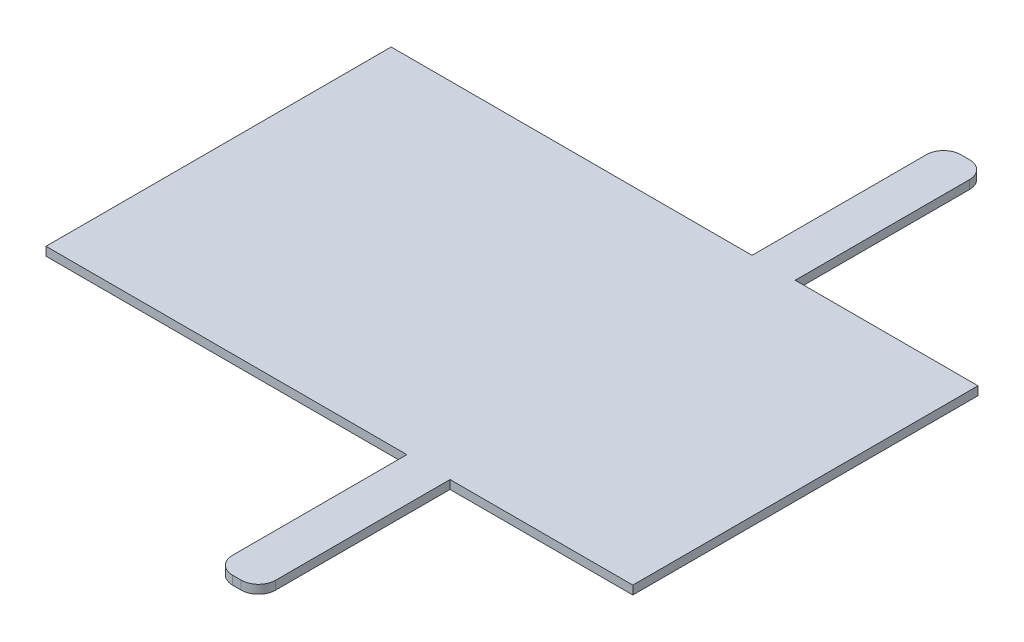
ISO-10303-21;
HEADER;
FILE_DESCRIPTION(('STEP AP214'),'2;1');
FILE_NAME('part.step','',(''),(''),'','','');
FILE_SCHEMA(('AUTOMOTIVE_DESIGN { 1 0 10303 214 1 1 1 1 }'));
ENDSEC;
DATA;
#1=APPLICATION_CONTEXT('core data for automotive mechanical design processes');
#2=APPLICATION_PROTOCOL_DEFINITION('international standard','automotive_design',2000,#1);
#3=PRODUCT_CONTEXT('',#1,'mechanical');
#4=PRODUCT('Part','Part','',(#3));
#5=PRODUCT_RELATED_PRODUCT_CATEGORY('part','',(#4));
#6=PRODUCT_DEFINITION_FORMATION('','',#4);
#7=PRODUCT_DEFINITION_CONTEXT('part definition',#1,'design');
#8=PRODUCT_DEFINITION('design','',#6,#7);
#9=PRODUCT_DEFINITION_SHAPE('','',#8);
#10=(LENGTH_UNIT() NAMED_UNIT(*) SI_UNIT(.MILLI.,.METRE.));
#11=(NAMED_UNIT(*) PLANE_ANGLE_UNIT() SI_UNIT($,.RADIAN.));
#12=(NAMED_UNIT(*) SI_UNIT($,.STERADIAN.) SOLID_ANGLE_UNIT());
#13=UNCERTAINTY_MEASURE_WITH_UNIT(LENGTH_MEASURE(1.E-05),#10,'distance_accuracy_value','');
#14=(GEOMETRIC_REPRESENTATION_CONTEXT(3) GLOBAL_UNCERTAINTY_ASSIGNED_CONTEXT((#13)) GLOBAL_UNIT_ASSIGNED_CONTEXT((#10,
#11,#12)) REPRESENTATION_CONTEXT('',''));
#15=CARTESIAN_POINT('',(0.,0.,0.));
#16=DIRECTION('',(0.,0.,1.));
#17=DIRECTION('',(1.,0.,0.));
#18=AXIS2_PLACEMENT_3D('',#15,#16,#17);
#19=CARTESIAN_POINT('',(-691.29647542446,5.,-422.631578947368));
#20=DIRECTION('',(1.,0.,0.));
#21=DIRECTION('',(0.,0.,-1.));
#22=AXIS2_PLACEMENT_3D('',#19,#20,#21);
#23=PLANE('',#22);
#24=DIRECTION('',(0.,0.,1.));
#25=VECTOR('',#24,1.);
#26=CARTESIAN_POINT('',(-691.29647542446,0.,-422.631578947368));
#27=LINE('',#26,#25);
#28=CARTESIAN_POINT('',(-691.29647542446,0.,-422.631578947368));
#29=VERTEX_POINT('',#28);
#30=CARTESIAN_POINT('',(-691.29647542446,0.,-222.631578947368));
#31=VERTEX_POINT('',#30);
#32=EDGE_CURVE('E190',#29,#31,#27,.T.);
#33=ORIENTED_EDGE('',*,*,#32,.T.);
#34=DIRECTION('',(0.,-1.,0.));
#35=VECTOR('',#34,1.);
#36=CARTESIAN_POINT('',(-691.29647542446,5.,-222.631578947368));
#37=LINE('',#36,#35);
#38=CARTESIAN_POINT('',(-691.29647542446,5.,-222.631578947368));
#39=VERTEX_POINT('',#38);
#40=EDGE_CURVE('E11',#39,#31,#37,.T.);
#41=ORIENTED_EDGE('',*,*,#40,.F.);
#42=DIRECTION('',(0.,0.,1.));
#43=VECTOR('',#42,1.);
#44=CARTESIAN_POINT('',(-691.29647542446,5.,-422.631578947368));
#45=LINE('',#44,#43);
#46=CARTESIAN_POINT('',(-691.29647542446,5.,-422.631578947368));
#47=VERTEX_POINT('',#46);
#48=EDGE_CURVE('E236',#47,#39,#45,.T.);
#49=ORIENTED_EDGE('',*,*,#48,.F.);
#50=DIRECTION('',(0.,-1.,0.));
#51=VECTOR('',#50,1.);
#52=CARTESIAN_POINT('',(-691.29647542446,5.,-422.631578947368));
#53=LINE('',#52,#51);
#54=EDGE_CURVE('E186',#47,#29,#53,.T.);
#55=ORIENTED_EDGE('',*,*,#54,.T.);
#56=EDGE_LOOP('',(#33,#41,#49,#55));
#57=FACE_BOUND('',#56,.T.);
#58=ADVANCED_FACE('F41',(#57),#23,.F.);
#59=CARTESIAN_POINT('',(-691.29647542446,5.,-222.631578947368));
#60=DIRECTION('',(0.,0.,-1.));
#61=DIRECTION('',(-1.,0.,0.));
#62=AXIS2_PLACEMENT_3D('',#59,#60,#61);
#63=PLANE('',#62);
#64=DIRECTION('',(1.,0.,0.));
#65=VECTOR('',#64,1.);
#66=CARTESIAN_POINT('',(-691.29647542446,0.,-222.631578947368));
#67=LINE('',#66,#65);
#68=CARTESIAN_POINT('',(-482.208642175763,0.,-222.631578947368));
#69=VERTEX_POINT('',#68);
#70=EDGE_CURVE('E194',#31,#69,#67,.T.);
#71=ORIENTED_EDGE('',*,*,#70,.T.);
#72=DIRECTION('',(0.,-1.,0.));
#73=VECTOR('',#72,1.);
#74=CARTESIAN_POINT('',(-482.208642175763,5.,-222.631578947368));
#75=LINE('',#74,#73);
#76=CARTESIAN_POINT('',(-482.208642175763,5.,-222.631578947368));
#77=VERTEX_POINT('',#76);
#78=EDGE_CURVE('E50',#77,#69,#75,.T.);
#79=ORIENTED_EDGE('',*,*,#78,.F.);
#80=DIRECTION('',(1.,0.,0.));
#81=VECTOR('',#80,1.);
#82=CARTESIAN_POINT('',(-691.29647542446,5.,-222.631578947368));
#83=LINE('',#82,#81);
#84=EDGE_CURVE('E125',#39,#77,#83,.T.);
#85=ORIENTED_EDGE('',*,*,#84,.F.);
#86=ORIENTED_EDGE('',*,*,#40,.T.);
#87=EDGE_LOOP('',(#71,#79,#85,#86));
#88=FACE_BOUND('',#87,.T.);
#89=ADVANCED_FACE('F358',(#88),#63,.F.);
#90=CARTESIAN_POINT('',(-482.208642175763,5.,-222.631578947368));
#91=DIRECTION('',(1.,0.,0.));
#92=DIRECTION('',(0.,0.,-1.));
#93=AXIS2_PLACEMENT_3D('',#90,#91,#92);
#94=PLANE('',#93);
#95=DIRECTION('',(0.,0.,1.));
#96=VECTOR('',#95,1.);
#97=CARTESIAN_POINT('',(-482.208642175763,0.,-222.631578947368));
#98=LINE('',#97,#96);
#99=CARTESIAN_POINT('',(-482.208642175763,0.,-121.631578947368));
#100=VERTEX_POINT('',#99);
#101=EDGE_CURVE('E197',#69,#100,#98,.T.);
#102=ORIENTED_EDGE('',*,*,#101,.T.);
#103=DIRECTION('',(0.,-1.,0.));
#104=VECTOR('',#103,1.);
#105=CARTESIAN_POINT('',(-482.208642175763,5.,-121.631578947368));
#106=LINE('',#105,#104);
#107=CARTESIAN_POINT('',(-482.208642175763,5.,-121.631578947368));
#108=VERTEX_POINT('',#107);
#109=EDGE_CURVE('E279',#108,#100,#106,.T.);
#110=ORIENTED_EDGE('',*,*,#109,.F.);
#111=DIRECTION('',(0.,0.,1.));
#112=VECTOR('',#111,1.);
#113=CARTESIAN_POINT('',(-482.208642175763,5.,-222.631578947368));
#114=LINE('',#113,#112);
#115=EDGE_CURVE('E289',#77,#108,#114,.T.);
#116=ORIENTED_EDGE('',*,*,#115,.F.);
#117=ORIENTED_EDGE('',*,*,#78,.T.);
#118=EDGE_LOOP('',(#102,#110,#116,#117));
#119=FACE_BOUND('',#118,.T.);
#120=ADVANCED_FACE('F287',(#119),#94,.F.);
#121=CARTESIAN_POINT('',(-472.208642175763,5.,-121.631578947368));
#122=DIRECTION('',(0.,-1.,0.));
#123=DIRECTION('',(0.,0.,-1.));
#124=AXIS2_PLACEMENT_3D('',#121,#122,#123);
#125=CYLINDRICAL_SURFACE('',#124,10.);
#126=CARTESIAN_POINT('',(-472.208642175763,0.,-121.631578947368));
#127=DIRECTION('',(0.,1.,0.));
#128=DIRECTION('',(0.,0.,1.));
#129=AXIS2_PLACEMENT_3D('',#126,#127,#128);
#130=CIRCLE('',#129,10.);
#131=CARTESIAN_POINT('',(-472.208642175763,0.,-111.631578947368));
#132=VERTEX_POINT('',#131);
#133=EDGE_CURVE('E200',#100,#132,#130,.T.);
#134=ORIENTED_EDGE('',*,*,#133,.T.);
#135=DIRECTION('',(0.,-1.,0.));
#136=VECTOR('',#135,1.);
#137=CARTESIAN_POINT('',(-472.208642175763,5.,-111.631578947368));
#138=LINE('',#137,#136);
#139=CARTESIAN_POINT('',(-472.208642175763,5.,-111.631578947368));
#140=VERTEX_POINT('',#139);
#141=EDGE_CURVE('E275',#140,#132,#138,.T.);
#142=ORIENTED_EDGE('',*,*,#141,.F.);
#143=CARTESIAN_POINT('',(-472.208642175763,5.,-121.631578947368));
#144=DIRECTION('',(0.,1.,0.));
#145=DIRECTION('',(0.,0.,1.));
#146=AXIS2_PLACEMENT_3D('',#143,#144,#145);
#147=CIRCLE('',#146,10.);
#148=EDGE_CURVE('E308',#108,#140,#147,.T.);
#149=ORIENTED_EDGE('',*,*,#148,.F.);
#150=ORIENTED_EDGE('',*,*,#109,.T.);
#151=EDGE_LOOP('',(#134,#142,#149,#150));
#152=FACE_BOUND('',#151,.T.);
#153=ADVANCED_FACE('F298',(#152),#125,.T.);
#154=CARTESIAN_POINT('',(-472.208642175763,5.,-111.631578947368));
#155=DIRECTION('',(0.,0.,-1.));
#156=DIRECTION('',(-1.,0.,0.));
#157=AXIS2_PLACEMENT_3D('',#154,#155,#156);
#158=PLANE('',#157);
#159=DIRECTION('',(1.,0.,0.));
#160=VECTOR('',#159,1.);
#161=CARTESIAN_POINT('',(-472.208642175763,0.,-111.631578947368));
#162=LINE('',#161,#160);
#163=CARTESIAN_POINT('',(-467.208642175763,0.,-111.631578947368));
#164=VERTEX_POINT('',#163);
#165=EDGE_CURVE('E203',#132,#164,#162,.T.);
#166=ORIENTED_EDGE('',*,*,#165,.T.);
#167=DIRECTION('',(0.,-1.,0.));
#168=VECTOR('',#167,1.);
#169=CARTESIAN_POINT('',(-467.208642175763,5.,-111.631578947368));
#170=LINE('',#169,#168);
#171=CARTESIAN_POINT('',(-467.208642175763,5.,-111.631578947368));
#172=VERTEX_POINT('',#171);
#173=EDGE_CURVE('E271',#172,#164,#170,.T.);
#174=ORIENTED_EDGE('',*,*,#173,.F.);
#175=DIRECTION('',(1.,0.,0.));
#176=VECTOR('',#175,1.);
#177=CARTESIAN_POINT('',(-472.208642175763,5.,-111.631578947368));
#178=LINE('',#177,#176);
#179=EDGE_CURVE('E304',#140,#172,#178,.T.);
#180=ORIENTED_EDGE('',*,*,#179,.F.);
#181=ORIENTED_EDGE('',*,*,#141,.T.);
#182=EDGE_LOOP('',(#166,#174,#180,#181));
#183=FACE_BOUND('',#182,.T.);
#184=ADVANCED_FACE('F302',(#183),#158,.F.);
#185=CARTESIAN_POINT('',(-467.208642175763,5.,-121.631578947368));
#186=DIRECTION('',(0.,-1.,0.));
#187=DIRECTION('',(0.,0.,-1.));
#188=AXIS2_PLACEMENT_3D('',#185,#186,#187);
#189=CYLINDRICAL_SURFACE('',#188,10.);
#190=CARTESIAN_POINT('',(-467.208642175763,0.,-121.631578947368));
#191=DIRECTION('',(0.,1.,0.));
#192=DIRECTION('',(0.,0.,1.));
#193=AXIS2_PLACEMENT_3D('',#190,#191,#192);
#194=CIRCLE('',#193,10.);
#195=CARTESIAN_POINT('',(-457.208642175763,0.,-121.631578947368));
#196=VERTEX_POINT('',#195);
#197=EDGE_CURVE('E206',#164,#196,#194,.T.);
#198=ORIENTED_EDGE('',*,*,#197,.T.);
#199=DIRECTION('',(0.,-1.,0.));
#200=VECTOR('',#199,1.);
#201=CARTESIAN_POINT('',(-457.208642175763,5.,-121.631578947368));
#202=LINE('',#201,#200);
#203=CARTESIAN_POINT('',(-457.208642175763,5.,-121.631578947368));
#204=VERTEX_POINT('',#203);
#205=EDGE_CURVE('E267',#204,#196,#202,.T.);
#206=ORIENTED_EDGE('',*,*,#205,.F.);
#207=CARTESIAN_POINT('',(-467.208642175763,5.,-121.631578947368));
#208=DIRECTION('',(0.,1.,0.));
#209=DIRECTION('',(0.,0.,1.));
#210=AXIS2_PLACEMENT_3D('',#207,#208,#209);
#211=CIRCLE('',#210,10.);
#212=EDGE_CURVE('E307',#172,#204,#211,.T.);
#213=ORIENTED_EDGE('',*,*,#212,.F.);
#214=ORIENTED_EDGE('',*,*,#173,.T.);
#215=EDGE_LOOP('',(#198,#206,#213,#214));
#216=FACE_BOUND('',#215,.T.);
#217=ADVANCED_FACE('F371',(#216),#189,.T.);
#218=CARTESIAN_POINT('',(-457.208642175763,5.,-222.631578947368));
#219=DIRECTION('',(-1.,0.,0.));
#220=DIRECTION('',(0.,0.,1.));
#221=AXIS2_PLACEMENT_3D('',#218,#219,#220);
#222=PLANE('',#221);
#223=DIRECTION('',(0.,0.,-1.));
#224=VECTOR('',#223,1.);
#225=CARTESIAN_POINT('',(-457.208642175763,0.,-222.631578947368));
#226=LINE('',#225,#224);
#227=CARTESIAN_POINT('',(-457.208642175763,0.,-222.631578947368));
#228=VERTEX_POINT('',#227);
#229=EDGE_CURVE('E209',#196,#228,#226,.T.);
#230=ORIENTED_EDGE('',*,*,#229,.T.);
#231=DIRECTION('',(0.,-1.,0.));
#232=VECTOR('',#231,1.);
#233=CARTESIAN_POINT('',(-457.208642175763,5.,-222.631578947368));
#234=LINE('',#233,#232);
#235=CARTESIAN_POINT('',(-457.208642175763,5.,-222.631578947368));
#236=VERTEX_POINT('',#235);
#237=EDGE_CURVE('E263',#236,#228,#234,.T.);
#238=ORIENTED_EDGE('',*,*,#237,.F.);
#239=DIRECTION('',(0.,0.,-1.));
#240=VECTOR('',#239,1.);
#241=CARTESIAN_POINT('',(-457.208642175763,5.,-222.631578947368));
#242=LINE('',#241,#240);
#243=EDGE_CURVE('E312',#204,#236,#242,.T.);
#244=ORIENTED_EDGE('',*,*,#243,.F.);
#245=ORIENTED_EDGE('',*,*,#205,.T.);
#246=EDGE_LOOP('',(#230,#238,#244,#245));
#247=FACE_BOUND('',#246,.T.);
#248=ADVANCED_FACE('F374',(#247),#222,.F.);
#249=CARTESIAN_POINT('',(-457.208642175763,5.,-222.631578947368));
#250=DIRECTION('',(0.,0.,-1.));
#251=DIRECTION('',(-1.,0.,0.));
#252=AXIS2_PLACEMENT_3D('',#249,#250,#251);
#253=PLANE('',#252);
#254=DIRECTION('',(1.,0.,0.));
#255=VECTOR('',#254,1.);
#256=CARTESIAN_POINT('',(-457.208642175763,0.,-222.631578947368));
#257=LINE('',#256,#255);
#258=CARTESIAN_POINT('',(-351.29647542446,0.,-222.631578947368));
#259=VERTEX_POINT('',#258);
#260=EDGE_CURVE('E212',#228,#259,#257,.T.);
#261=ORIENTED_EDGE('',*,*,#260,.T.);
#262=DIRECTION('',(0.,-1.,0.));
#263=VECTOR('',#262,1.);
#264=CARTESIAN_POINT('',(-351.29647542446,5.,-222.631578947368));
#265=LINE('',#264,#263);
#266=CARTESIAN_POINT('',(-351.29647542446,5.,-222.631578947368));
#267=VERTEX_POINT('',#266);
#268=EDGE_CURVE('E259',#267,#259,#265,.T.);
#269=ORIENTED_EDGE('',*,*,#268,.F.);
#270=DIRECTION('',(1.,0.,0.));
#271=VECTOR('',#270,1.);
#272=CARTESIAN_POINT('',(-457.208642175763,5.,-222.631578947368));
#273=LINE('',#272,#271);
#274=EDGE_CURVE('E319',#236,#267,#273,.T.);
#275=ORIENTED_EDGE('',*,*,#274,.F.);
#276=ORIENTED_EDGE('',*,*,#237,.T.);
#277=EDGE_LOOP('',(#261,#269,#275,#276));
#278=FACE_BOUND('',#277,.T.);
#279=ADVANCED_FACE('F378',(#278),#253,.F.);
#280=CARTESIAN_POINT('',(-351.29647542446,5.,-422.631578947368));
#281=DIRECTION('',(-1.,0.,0.));
#282=DIRECTION('',(0.,0.,1.));
#283=AXIS2_PLACEMENT_3D('',#280,#281,#282);
#284=PLANE('',#283);
#285=DIRECTION('',(0.,0.,-1.));
#286=VECTOR('',#285,1.);
#287=CARTESIAN_POINT('',(-351.29647542446,0.,-422.631578947368));
#288=LINE('',#287,#286);
#289=CARTESIAN_POINT('',(-351.29647542446,0.,-422.631578947368));
#290=VERTEX_POINT('',#289);
#291=EDGE_CURVE('E215',#259,#290,#288,.T.);
#292=ORIENTED_EDGE('',*,*,#291,.T.);
#293=DIRECTION('',(0.,-1.,0.));
#294=VECTOR('',#293,1.);
#295=CARTESIAN_POINT('',(-351.29647542446,5.,-422.631578947368));
#296=LINE('',#295,#294);
#297=CARTESIAN_POINT('',(-351.29647542446,5.,-422.631578947368));
#298=VERTEX_POINT('',#297);
#299=EDGE_CURVE('E255',#298,#290,#296,.T.);
#300=ORIENTED_EDGE('',*,*,#299,.F.);
#301=DIRECTION('',(0.,0.,-1.));
#302=VECTOR('',#301,1.);
#303=CARTESIAN_POINT('',(-351.29647542446,5.,-422.631578947368));
#304=LINE('',#303,#302);
#305=EDGE_CURVE('E322',#267,#298,#304,.T.);
#306=ORIENTED_EDGE('',*,*,#305,.F.);
#307=ORIENTED_EDGE('',*,*,#268,.T.);
#308=EDGE_LOOP('',(#292,#300,#306,#307));
#309=FACE_BOUND('',#308,.T.);
#310=ADVANCED_FACE('F382',(#309),#284,.F.);
#311=CARTESIAN_POINT('',(-457.208642175763,5.,-422.631578947368));
#312=DIRECTION('',(0.,0.,1.));
#313=DIRECTION('',(1.,0.,0.));
#314=AXIS2_PLACEMENT_3D('',#311,#312,#313);
#315=PLANE('',#314);
#316=DIRECTION('',(-1.,0.,0.));
#317=VECTOR('',#316,1.);
#318=CARTESIAN_POINT('',(-457.208642175763,0.,-422.631578947368));
#319=LINE('',#318,#317);
#320=CARTESIAN_POINT('',(-457.208642175763,0.,-422.631578947368));
#321=VERTEX_POINT('',#320);
#322=EDGE_CURVE('E218',#290,#321,#319,.T.);
#323=ORIENTED_EDGE('',*,*,#322,.T.);
#324=DIRECTION('',(0.,-1.,0.));
#325=VECTOR('',#324,1.);
#326=CARTESIAN_POINT('',(-457.208642175763,5.,-422.631578947368));
#327=LINE('',#326,#325);
#328=CARTESIAN_POINT('',(-457.208642175763,5.,-422.631578947368));
#329=VERTEX_POINT('',#328);
#330=EDGE_CURVE('E251',#329,#321,#327,.T.);
#331=ORIENTED_EDGE('',*,*,#330,.F.);
#332=DIRECTION('',(-1.,0.,0.));
#333=VECTOR('',#332,1.);
#334=CARTESIAN_POINT('',(-457.208642175763,5.,-422.631578947368));
#335=LINE('',#334,#333);
#336=EDGE_CURVE('E325',#298,#329,#335,.T.);
#337=ORIENTED_EDGE('',*,*,#336,.F.);
#338=ORIENTED_EDGE('',*,*,#299,.T.);
#339=EDGE_LOOP('',(#323,#331,#337,#338));
#340=FACE_BOUND('',#339,.T.);
#341=ADVANCED_FACE('F386',(#340),#315,.F.);
#342=CARTESIAN_POINT('',(-457.208642175763,5.,-422.631578947368));
#343=DIRECTION('',(-1.,0.,0.));
#344=DIRECTION('',(0.,0.,1.));
#345=AXIS2_PLACEMENT_3D('',#342,#343,#344);
#346=PLANE('',#345);
#347=DIRECTION('',(0.,0.,-1.));
#348=VECTOR('',#347,1.);
#349=CARTESIAN_POINT('',(-457.208642175763,0.,-422.631578947368));
#350=LINE('',#349,#348);
#351=CARTESIAN_POINT('',(-457.208642175763,0.,-523.631578947368));
#352=VERTEX_POINT('',#351);
#353=EDGE_CURVE('E221',#321,#352,#350,.T.);
#354=ORIENTED_EDGE('',*,*,#353,.T.);
#355=DIRECTION('',(0.,-1.,0.));
#356=VECTOR('',#355,1.);
#357=CARTESIAN_POINT('',(-457.208642175763,5.,-523.631578947368));
#358=LINE('',#357,#356);
#359=CARTESIAN_POINT('',(-457.208642175763,5.,-523.631578947368));
#360=VERTEX_POINT('',#359);
#361=EDGE_CURVE('E247',#360,#352,#358,.T.);
#362=ORIENTED_EDGE('',*,*,#361,.F.);
#363=DIRECTION('',(0.,0.,-1.));
#364=VECTOR('',#363,1.);
#365=CARTESIAN_POINT('',(-457.208642175763,5.,-422.631578947368));
#366=LINE('',#365,#364);
#367=EDGE_CURVE('E328',#329,#360,#366,.T.);
#368=ORIENTED_EDGE('',*,*,#367,.F.);
#369=ORIENTED_EDGE('',*,*,#330,.T.);
#370=EDGE_LOOP('',(#354,#362,#368,#369));
#371=FACE_BOUND('',#370,.T.);
#372=ADVANCED_FACE('F390',(#371),#346,.F.);
#373=CARTESIAN_POINT('',(-467.208642175763,5.,-523.631578947368));
#374=DIRECTION('',(0.,-1.,0.));
#375=DIRECTION('',(0.,0.,-1.));
#376=AXIS2_PLACEMENT_3D('',#373,#374,#375);
#377=CYLINDRICAL_SURFACE('',#376,10.);
#378=CARTESIAN_POINT('',(-467.208642175763,0.,-523.631578947368));
#379=DIRECTION('',(0.,1.,0.));
#380=DIRECTION('',(0.,0.,-1.));
#381=AXIS2_PLACEMENT_3D('',#378,#379,#380);
#382=CIRCLE('',#381,10.);
#383=CARTESIAN_POINT('',(-467.208642175763,0.,-533.631578947368));
#384=VERTEX_POINT('',#383);
#385=EDGE_CURVE('E224',#352,#384,#382,.T.);
#386=ORIENTED_EDGE('',*,*,#385,.T.);
#387=DIRECTION('',(0.,-1.,0.));
#388=VECTOR('',#387,1.);
#389=CARTESIAN_POINT('',(-467.208642175763,5.,-533.631578947368));
#390=LINE('',#389,#388);
#391=CARTESIAN_POINT('',(-467.208642175763,5.,-533.631578947368));
#392=VERTEX_POINT('',#391);
#393=EDGE_CURVE('E243',#392,#384,#390,.T.);
#394=ORIENTED_EDGE('',*,*,#393,.F.);
#395=CARTESIAN_POINT('',(-467.208642175763,5.,-523.631578947368));
#396=DIRECTION('',(0.,1.,0.));
#397=DIRECTION('',(0.,0.,-1.));
#398=AXIS2_PLACEMENT_3D('',#395,#396,#397);
#399=CIRCLE('',#398,10.);
#400=EDGE_CURVE('E331',#360,#392,#399,.T.);
#401=ORIENTED_EDGE('',*,*,#400,.F.);
#402=ORIENTED_EDGE('',*,*,#361,.T.);
#403=EDGE_LOOP('',(#386,#394,#401,#402));
#404=FACE_BOUND('',#403,.T.);
#405=ADVANCED_FACE('F339',(#404),#377,.T.);
#406=CARTESIAN_POINT('',(-472.208642175763,5.,-533.631578947368));
#407=DIRECTION('',(0.,0.,1.));
#408=DIRECTION('',(1.,0.,0.));
#409=AXIS2_PLACEMENT_3D('',#406,#407,#408);
#410=PLANE('',#409);
#411=DIRECTION('',(-1.,0.,0.));
#412=VECTOR('',#411,1.);
#413=CARTESIAN_POINT('',(-472.208642175763,0.,-533.631578947368));
#414=LINE('',#413,#412);
#415=CARTESIAN_POINT('',(-472.208642175763,0.,-533.631578947368));
#416=VERTEX_POINT('',#415);
#417=EDGE_CURVE('E227',#384,#416,#414,.T.);
#418=ORIENTED_EDGE('',*,*,#417,.T.);
#419=DIRECTION('',(0.,-1.,0.));
#420=VECTOR('',#419,1.);
#421=CARTESIAN_POINT('',(-472.208642175763,5.,-533.631578947368));
#422=LINE('',#421,#420);
#423=CARTESIAN_POINT('',(-472.208642175763,5.,-533.631578947368));
#424=VERTEX_POINT('',#423);
#425=EDGE_CURVE('E179',#424,#416,#422,.T.);
#426=ORIENTED_EDGE('',*,*,#425,.F.);
#427=DIRECTION('',(-1.,0.,0.));
#428=VECTOR('',#427,1.);
#429=CARTESIAN_POINT('',(-472.208642175763,5.,-533.631578947368));
#430=LINE('',#429,#428);
#431=EDGE_CURVE('E168',#392,#424,#430,.T.);
#432=ORIENTED_EDGE('',*,*,#431,.F.);
#433=ORIENTED_EDGE('',*,*,#393,.T.);
#434=EDGE_LOOP('',(#418,#426,#432,#433));
#435=FACE_BOUND('',#434,.T.);
#436=ADVANCED_FACE('F343',(#435),#410,.F.);
#437=CARTESIAN_POINT('',(-472.208642175763,5.,-523.631578947368));
#438=DIRECTION('',(0.,-1.,0.));
#439=DIRECTION('',(0.,0.,-1.));
#440=AXIS2_PLACEMENT_3D('',#437,#438,#439);
#441=CYLINDRICAL_SURFACE('',#440,10.);
#442=CARTESIAN_POINT('',(-472.208642175763,0.,-523.631578947368));
#443=DIRECTION('',(0.,1.,0.));
#444=DIRECTION('',(0.,0.,-1.));
#445=AXIS2_PLACEMENT_3D('',#442,#443,#444);
#446=CIRCLE('',#445,10.);
#447=CARTESIAN_POINT('',(-482.208642175763,0.,-523.631578947368));
#448=VERTEX_POINT('',#447);
#449=EDGE_CURVE('E177',#416,#448,#446,.T.);
#450=ORIENTED_EDGE('',*,*,#449,.T.);
#451=DIRECTION('',(0.,-1.,0.));
#452=VECTOR('',#451,1.);
#453=CARTESIAN_POINT('',(-482.208642175763,5.,-523.631578947368));
#454=LINE('',#453,#452);
#455=CARTESIAN_POINT('',(-482.208642175763,5.,-523.631578947368));
#456=VERTEX_POINT('',#455);
#457=EDGE_CURVE('E174',#456,#448,#454,.T.);
#458=ORIENTED_EDGE('',*,*,#457,.F.);
#459=CARTESIAN_POINT('',(-472.208642175763,5.,-523.631578947368));
#460=DIRECTION('',(0.,1.,0.));
#461=DIRECTION('',(0.,0.,-1.));
#462=AXIS2_PLACEMENT_3D('',#459,#460,#461);
#463=CIRCLE('',#462,10.);
#464=EDGE_CURVE('E162',#424,#456,#463,.T.);
#465=ORIENTED_EDGE('',*,*,#464,.F.);
#466=ORIENTED_EDGE('',*,*,#425,.T.);
#467=EDGE_LOOP('',(#450,#458,#465,#466));
#468=FACE_BOUND('',#467,.T.);
#469=ADVANCED_FACE('F175',(#468),#441,.T.);
#470=CARTESIAN_POINT('',(-482.208642175763,5.,-422.631578947368));
#471=DIRECTION('',(1.,0.,0.));
#472=DIRECTION('',(0.,0.,-1.));
#473=AXIS2_PLACEMENT_3D('',#470,#471,#472);
#474=PLANE('',#473);
#475=DIRECTION('',(0.,0.,1.));
#476=VECTOR('',#475,1.);
#477=CARTESIAN_POINT('',(-482.208642175763,0.,-422.631578947368));
#478=LINE('',#477,#476);
#479=CARTESIAN_POINT('',(-482.208642175763,0.,-422.631578947368));
#480=VERTEX_POINT('',#479);
#481=EDGE_CURVE('E111',#448,#480,#478,.T.);
#482=ORIENTED_EDGE('',*,*,#481,.T.);
#483=DIRECTION('',(0.,-1.,0.));
#484=VECTOR('',#483,1.);
#485=CARTESIAN_POINT('',(-482.208642175763,5.,-422.631578947368));
#486=LINE('',#485,#484);
#487=CARTESIAN_POINT('',(-482.208642175763,5.,-422.631578947368));
#488=VERTEX_POINT('',#487);
#489=EDGE_CURVE('E180',#488,#480,#486,.T.);
#490=ORIENTED_EDGE('',*,*,#489,.F.);
#491=DIRECTION('',(0.,0.,1.));
#492=VECTOR('',#491,1.);
#493=CARTESIAN_POINT('',(-482.208642175763,5.,-422.631578947368));
#494=LINE('',#493,#492);
#495=EDGE_CURVE('E166',#456,#488,#494,.T.);
#496=ORIENTED_EDGE('',*,*,#495,.F.);
#497=ORIENTED_EDGE('',*,*,#457,.T.);
#498=EDGE_LOOP('',(#482,#490,#496,#497));
#499=FACE_BOUND('',#498,.T.);
#500=ADVANCED_FACE('F182',(#499),#474,.F.);
#501=CARTESIAN_POINT('',(-691.29647542446,5.,-422.631578947368));
#502=DIRECTION('',(0.,0.,1.));
#503=DIRECTION('',(1.,0.,0.));
#504=AXIS2_PLACEMENT_3D('',#501,#502,#503);
#505=PLANE('',#504);
#506=DIRECTION('',(-1.,0.,0.));
#507=VECTOR('',#506,1.);
#508=CARTESIAN_POINT('',(-691.29647542446,0.,-422.631578947368));
#509=LINE('',#508,#507);
#510=EDGE_CURVE('E117',#480,#29,#509,.T.);
#511=ORIENTED_EDGE('',*,*,#510,.T.);
#512=ORIENTED_EDGE('',*,*,#54,.F.);
#513=DIRECTION('',(-1.,0.,0.));
#514=VECTOR('',#513,1.);
#515=CARTESIAN_POINT('',(-691.29647542446,5.,-422.631578947368));
#516=LINE('',#515,#514);
#517=EDGE_CURVE('E58',#488,#47,#516,.T.);
#518=ORIENTED_EDGE('',*,*,#517,.F.);
#519=ORIENTED_EDGE('',*,*,#489,.T.);
#520=EDGE_LOOP('',(#511,#512,#518,#519));
#521=FACE_BOUND('',#520,.T.);
#522=ADVANCED_FACE('F347',(#521),#505,.F.);
#523=CARTESIAN_POINT('',(-472.208642175763,5.,-121.631578947368));
#524=DIRECTION('',(0.,1.,0.));
#525=DIRECTION('',(0.,0.,1.));
#526=AXIS2_PLACEMENT_3D('',#523,#524,#525);
#527=PLANE('',#526);
#528=ORIENTED_EDGE('',*,*,#48,.T.);
#529=ORIENTED_EDGE('',*,*,#84,.T.);
#530=ORIENTED_EDGE('',*,*,#115,.T.);
#531=ORIENTED_EDGE('',*,*,#148,.T.);
#532=ORIENTED_EDGE('',*,*,#179,.T.);
#533=ORIENTED_EDGE('',*,*,#212,.T.);
#534=ORIENTED_EDGE('',*,*,#243,.T.);
#535=ORIENTED_EDGE('',*,*,#274,.T.);
#536=ORIENTED_EDGE('',*,*,#305,.T.);
#537=ORIENTED_EDGE('',*,*,#336,.T.);
#538=ORIENTED_EDGE('',*,*,#367,.T.);
#539=ORIENTED_EDGE('',*,*,#400,.T.);
#540=ORIENTED_EDGE('',*,*,#431,.T.);
#541=ORIENTED_EDGE('',*,*,#464,.T.);
#542=ORIENTED_EDGE('',*,*,#495,.T.);
#543=ORIENTED_EDGE('',*,*,#517,.T.);
#544=EDGE_LOOP('',(#528,#529,#530,#531,#532,#533,#534,#535,#536,#537,#538,#539,#540,#541,#542,#543));
#545=FACE_BOUND('',#544,.T.);
#546=ADVANCED_FACE('F164',(#545),#527,.T.);
#547=CARTESIAN_POINT('',(-472.208642175763,0.,-121.631578947368));
#548=DIRECTION('',(0.,1.,0.));
#549=DIRECTION('',(0.,0.,1.));
#550=AXIS2_PLACEMENT_3D('',#547,#548,#549);
#551=PLANE('',#550);
#552=ORIENTED_EDGE('',*,*,#32,.F.);
#553=ORIENTED_EDGE('',*,*,#510,.F.);
#554=ORIENTED_EDGE('',*,*,#481,.F.);
#555=ORIENTED_EDGE('',*,*,#449,.F.);
#556=ORIENTED_EDGE('',*,*,#417,.F.);
#557=ORIENTED_EDGE('',*,*,#385,.F.);
#558=ORIENTED_EDGE('',*,*,#353,.F.);
#559=ORIENTED_EDGE('',*,*,#322,.F.);
#560=ORIENTED_EDGE('',*,*,#291,.F.);
#561=ORIENTED_EDGE('',*,*,#260,.F.);
#562=ORIENTED_EDGE('',*,*,#229,.F.);
#563=ORIENTED_EDGE('',*,*,#197,.F.);
#564=ORIENTED_EDGE('',*,*,#165,.F.);
#565=ORIENTED_EDGE('',*,*,#133,.F.);
#566=ORIENTED_EDGE('',*,*,#101,.F.);
#567=ORIENTED_EDGE('',*,*,#70,.F.);
#568=EDGE_LOOP('',(#552,#553,#554,#555,#556,#557,#558,#559,#560,#561,#562,#563,#564,#565,#566,#567));
#569=FACE_BOUND('',#568,.T.);
#570=ADVANCED_FACE('F293',(#569),#551,.F.);
#571=CLOSED_SHELL('',(#58,#89,#120,#153,#184,#217,#248,#279,#310,#341,#372,#405,#436,#469,#500,
#522,#546,#570));
#572=MANIFOLD_SOLID_BREP('B2',#571);
#573=ADVANCED_BREP_SHAPE_REPRESENTATION('',(#18,#572),#14);
#574=SHAPE_DEFINITION_REPRESENTATION(#9,#573);
ENDSEC;
END-ISO-10303-21;
